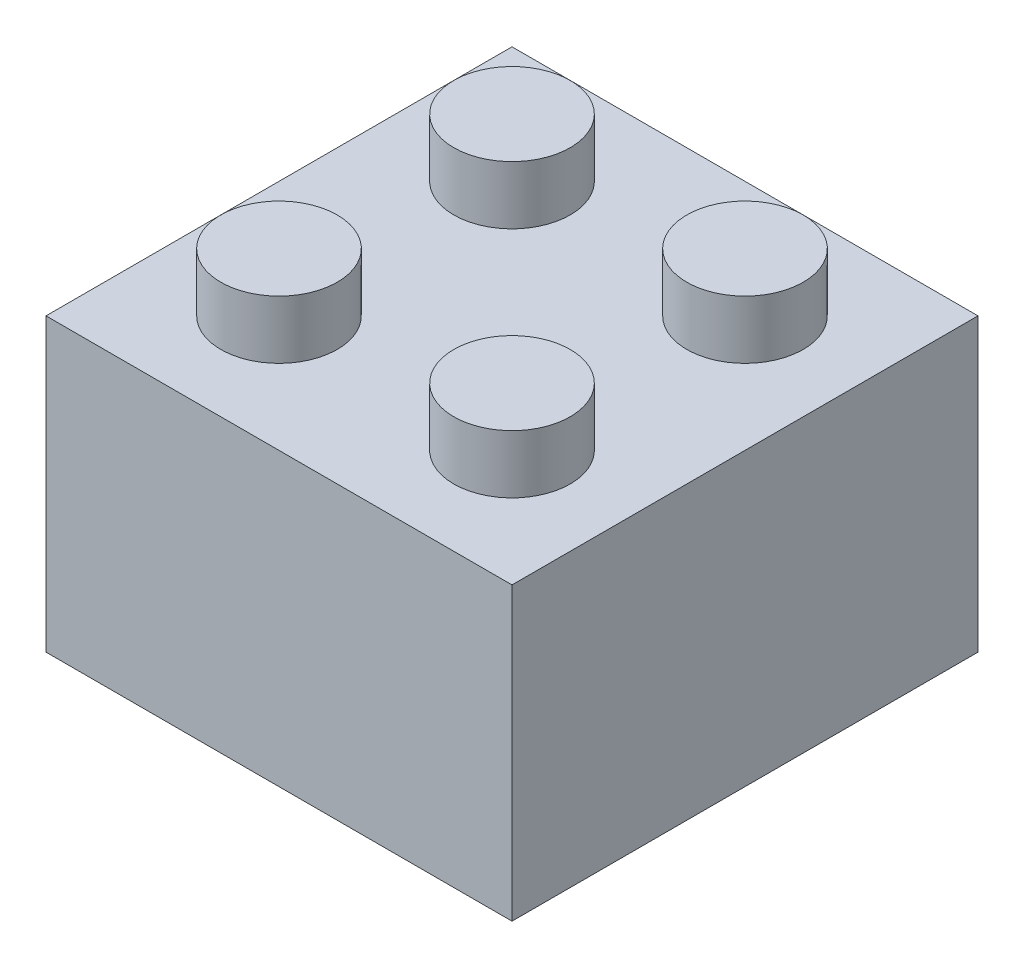
ISO-10303-21;
HEADER;
FILE_DESCRIPTION(('STEP AP214'),'2;1');
FILE_NAME('part.step','',(''),(''),'','','');
FILE_SCHEMA(('AUTOMOTIVE_DESIGN { 1 0 10303 214 1 1 1 1 }'));
ENDSEC;
DATA;
#1=APPLICATION_CONTEXT('core data for automotive mechanical design processes');
#2=APPLICATION_PROTOCOL_DEFINITION('international standard','automotive_design',2000,#1);
#3=PRODUCT_CONTEXT('',#1,'mechanical');
#4=PRODUCT('Part','Part','',(#3));
#5=PRODUCT_RELATED_PRODUCT_CATEGORY('part','',(#4));
#6=PRODUCT_DEFINITION_FORMATION('','',#4);
#7=PRODUCT_DEFINITION_CONTEXT('part definition',#1,'design');
#8=PRODUCT_DEFINITION('design','',#6,#7);
#9=PRODUCT_DEFINITION_SHAPE('','',#8);
#10=(LENGTH_UNIT() NAMED_UNIT(*) SI_UNIT(.MILLI.,.METRE.));
#11=(NAMED_UNIT(*) PLANE_ANGLE_UNIT() SI_UNIT($,.RADIAN.));
#12=(NAMED_UNIT(*) SI_UNIT($,.STERADIAN.) SOLID_ANGLE_UNIT());
#13=UNCERTAINTY_MEASURE_WITH_UNIT(LENGTH_MEASURE(1.E-05),#10,'distance_accuracy_value','');
#14=(GEOMETRIC_REPRESENTATION_CONTEXT(3) GLOBAL_UNCERTAINTY_ASSIGNED_CONTEXT((#13)) GLOBAL_UNIT_ASSIGNED_CONTEXT((#10,
#11,#12)) REPRESENTATION_CONTEXT('',''));
#15=CARTESIAN_POINT('',(0.,0.,0.));
#16=DIRECTION('',(0.,0.,1.));
#17=DIRECTION('',(1.,0.,0.));
#18=AXIS2_PLACEMENT_3D('',#15,#16,#17);
#19=CARTESIAN_POINT('',(0.,9.,0.));
#20=DIRECTION('',(0.,1.,0.));
#21=DIRECTION('',(0.,0.,1.));
#22=AXIS2_PLACEMENT_3D('',#19,#20,#21);
#23=PLANE('',#22);
#24=CARTESIAN_POINT('',(-3.99999999999999,9.,4.));
#25=DIRECTION('',(0.,1.,0.));
#26=DIRECTION('',(0.,0.,1.));
#27=AXIS2_PLACEMENT_3D('',#24,#25,#26);
#28=CIRCLE('',#27,1.);
#29=CARTESIAN_POINT('',(-3.99999999999999,9.,5.));
#30=VERTEX_POINT('',#29);
#31=EDGE_CURVE('E161',#30,#30,#28,.T.);
#32=ORIENTED_EDGE('',*,*,#31,.T.);
#33=EDGE_LOOP('',(#32));
#34=FACE_BOUND('',#33,.T.);
#35=CARTESIAN_POINT('',(-3.99999999999999,9.,-4.));
#36=DIRECTION('',(0.,1.,0.));
#37=DIRECTION('',(0.,0.,1.));
#38=AXIS2_PLACEMENT_3D('',#35,#36,#37);
#39=CIRCLE('',#38,1.);
#40=CARTESIAN_POINT('',(-3.99999999999999,9.,-3.));
#41=VERTEX_POINT('',#40);
#42=EDGE_CURVE('E156',#41,#41,#39,.T.);
#43=ORIENTED_EDGE('',*,*,#42,.T.);
#44=EDGE_LOOP('',(#43));
#45=FACE_BOUND('',#44,.T.);
#46=DIRECTION('',(0.,0.,1.));
#47=VECTOR('',#46,1.);
#48=CARTESIAN_POINT('',(-6.99999999999999,9.,8.));
#49=LINE('',#48,#47);
#50=CARTESIAN_POINT('',(-6.99999999999999,9.,-7.));
#51=VERTEX_POINT('',#50);
#52=CARTESIAN_POINT('',(-6.99999999999999,9.,7.));
#53=VERTEX_POINT('',#52);
#54=EDGE_CURVE('E124',#51,#53,#49,.T.);
#55=ORIENTED_EDGE('',*,*,#54,.F.);
#56=DIRECTION('',(-1.,0.,0.));
#57=VECTOR('',#56,1.);
#58=CARTESIAN_POINT('',(8.00000000000001,9.,-7.));
#59=LINE('',#58,#57);
#60=CARTESIAN_POINT('',(7.00000000000001,9.,-7.));
#61=VERTEX_POINT('',#60);
#62=EDGE_CURVE('E132',#61,#51,#59,.T.);
#63=ORIENTED_EDGE('',*,*,#62,.F.);
#64=DIRECTION('',(0.,0.,-1.));
#65=VECTOR('',#64,1.);
#66=CARTESIAN_POINT('',(7.00000000000001,9.,8.));
#67=LINE('',#66,#65);
#68=CARTESIAN_POINT('',(7.00000000000001,9.,7.));
#69=VERTEX_POINT('',#68);
#70=EDGE_CURVE('E123',#69,#61,#67,.T.);
#71=ORIENTED_EDGE('',*,*,#70,.F.);
#72=DIRECTION('',(1.,0.,0.));
#73=VECTOR('',#72,1.);
#74=CARTESIAN_POINT('',(8.00000000000001,9.,7.));
#75=LINE('',#74,#73);
#76=EDGE_CURVE('E113',#53,#69,#75,.T.);
#77=ORIENTED_EDGE('',*,*,#76,.F.);
#78=EDGE_LOOP('',(#55,#63,#71,#77));
#79=FACE_BOUND('',#78,.T.);
#80=CARTESIAN_POINT('',(4.00000000000001,9.,-4.));
#81=DIRECTION('',(0.,1.,0.));
#82=DIRECTION('',(0.,0.,1.));
#83=AXIS2_PLACEMENT_3D('',#80,#81,#82);
#84=CIRCLE('',#83,1.);
#85=CARTESIAN_POINT('',(4.00000000000001,9.,-3.));
#86=VERTEX_POINT('',#85);
#87=EDGE_CURVE('E138',#86,#86,#84,.T.);
#88=ORIENTED_EDGE('',*,*,#87,.T.);
#89=EDGE_LOOP('',(#88));
#90=FACE_BOUND('',#89,.T.);
#91=CARTESIAN_POINT('',(4.00000000000001,9.,4.));
#92=DIRECTION('',(0.,1.,0.));
#93=DIRECTION('',(0.,0.,1.));
#94=AXIS2_PLACEMENT_3D('',#91,#92,#93);
#95=CIRCLE('',#94,1.);
#96=CARTESIAN_POINT('',(4.00000000000001,9.,5.));
#97=VERTEX_POINT('',#96);
#98=EDGE_CURVE('E143',#97,#97,#95,.T.);
#99=ORIENTED_EDGE('',*,*,#98,.T.);
#100=EDGE_LOOP('',(#99));
#101=FACE_BOUND('',#100,.T.);
#102=CARTESIAN_POINT('',(0.,9.,0.));
#103=DIRECTION('',(0.,1.,0.));
#104=DIRECTION('',(0.,0.,1.));
#105=AXIS2_PLACEMENT_3D('',#102,#103,#104);
#106=CIRCLE('',#105,2.7);
#107=CARTESIAN_POINT('',(0.,9.,2.7));
#108=VERTEX_POINT('',#107);
#109=EDGE_CURVE('E12',#108,#108,#106,.F.);
#110=ORIENTED_EDGE('',*,*,#109,.F.);
#111=EDGE_LOOP('',(#110));
#112=FACE_BOUND('',#111,.T.);
#113=ADVANCED_FACE('F38',(#34,#45,#79,#90,#101,#112),#23,.F.);
#114=CARTESIAN_POINT('',(0.,10.,0.));
#115=DIRECTION('',(0.,1.,0.));
#116=DIRECTION('',(0.,0.,1.));
#117=AXIS2_PLACEMENT_3D('',#114,#115,#116);
#118=PLANE('',#117);
#119=CARTESIAN_POINT('',(-3.99999999999999,10.,4.));
#120=DIRECTION('',(0.,1.,0.));
#121=DIRECTION('',(0.,0.,-1.));
#122=AXIS2_PLACEMENT_3D('',#119,#120,#121);
#123=CIRCLE('',#122,2.);
#124=CARTESIAN_POINT('',(-3.99999999999999,10.,2.));
#125=VERTEX_POINT('',#124);
#126=EDGE_CURVE('E175',#125,#125,#123,.T.);
#127=ORIENTED_EDGE('',*,*,#126,.F.);
#128=EDGE_LOOP('',(#127));
#129=FACE_BOUND('',#128,.T.);
#130=CARTESIAN_POINT('',(-3.99999999999999,10.,-4.));
#131=DIRECTION('',(0.,1.,0.));
#132=DIRECTION('',(0.,0.,1.));
#133=AXIS2_PLACEMENT_3D('',#130,#131,#132);
#134=CIRCLE('',#133,2.);
#135=CARTESIAN_POINT('',(-3.99999999999999,10.,-2.));
#136=VERTEX_POINT('',#135);
#137=EDGE_CURVE('E187',#136,#136,#134,.T.);
#138=ORIENTED_EDGE('',*,*,#137,.F.);
#139=EDGE_LOOP('',(#138));
#140=FACE_BOUND('',#139,.T.);
#141=DIRECTION('',(0.,0.,1.));
#142=VECTOR('',#141,1.);
#143=CARTESIAN_POINT('',(-7.99999999999999,10.,8.));
#144=LINE('',#143,#142);
#145=CARTESIAN_POINT('',(-7.99999999999999,10.,-8.));
#146=VERTEX_POINT('',#145);
#147=CARTESIAN_POINT('',(-7.99999999999999,10.,8.));
#148=VERTEX_POINT('',#147);
#149=EDGE_CURVE('E196',#146,#148,#144,.T.);
#150=ORIENTED_EDGE('',*,*,#149,.T.);
#151=DIRECTION('',(1.,0.,0.));
#152=VECTOR('',#151,1.);
#153=CARTESIAN_POINT('',(8.00000000000001,10.,8.));
#154=LINE('',#153,#152);
#155=CARTESIAN_POINT('',(8.00000000000001,10.,8.));
#156=VERTEX_POINT('',#155);
#157=EDGE_CURVE('E91',#148,#156,#154,.T.);
#158=ORIENTED_EDGE('',*,*,#157,.T.);
#159=DIRECTION('',(0.,0.,-1.));
#160=VECTOR('',#159,1.);
#161=CARTESIAN_POINT('',(8.00000000000001,10.,8.));
#162=LINE('',#161,#160);
#163=CARTESIAN_POINT('',(8.00000000000001,10.,-8.));
#164=VERTEX_POINT('',#163);
#165=EDGE_CURVE('E199',#156,#164,#162,.T.);
#166=ORIENTED_EDGE('',*,*,#165,.T.);
#167=DIRECTION('',(-1.,0.,0.));
#168=VECTOR('',#167,1.);
#169=CARTESIAN_POINT('',(8.00000000000001,10.,-8.));
#170=LINE('',#169,#168);
#171=EDGE_CURVE('E62',#164,#146,#170,.T.);
#172=ORIENTED_EDGE('',*,*,#171,.T.);
#173=EDGE_LOOP('',(#150,#158,#166,#172));
#174=FACE_BOUND('',#173,.T.);
#175=CARTESIAN_POINT('',(4.00000000000001,10.,-4.));
#176=DIRECTION('',(0.,1.,0.));
#177=DIRECTION('',(0.,0.,-1.));
#178=AXIS2_PLACEMENT_3D('',#175,#176,#177);
#179=CIRCLE('',#178,2.);
#180=CARTESIAN_POINT('',(4.00000000000001,10.,-6.));
#181=VERTEX_POINT('',#180);
#182=EDGE_CURVE('E181',#181,#181,#179,.T.);
#183=ORIENTED_EDGE('',*,*,#182,.F.);
#184=EDGE_LOOP('',(#183));
#185=FACE_BOUND('',#184,.T.);
#186=CARTESIAN_POINT('',(4.00000000000001,10.,4.));
#187=DIRECTION('',(0.,1.,0.));
#188=DIRECTION('',(0.,0.,1.));
#189=AXIS2_PLACEMENT_3D('',#186,#187,#188);
#190=CIRCLE('',#189,2.);
#191=CARTESIAN_POINT('',(4.00000000000001,10.,6.));
#192=VERTEX_POINT('',#191);
#193=EDGE_CURVE('E149',#192,#192,#190,.T.);
#194=ORIENTED_EDGE('',*,*,#193,.F.);
#195=EDGE_LOOP('',(#194));
#196=FACE_BOUND('',#195,.T.);
#197=ADVANCED_FACE('F228',(#129,#140,#174,#185,#196),#118,.T.);
#198=CARTESIAN_POINT('',(-7.99999999999999,10.,8.));
#199=DIRECTION('',(1.,0.,0.));
#200=DIRECTION('',(0.,0.,-1.));
#201=AXIS2_PLACEMENT_3D('',#198,#199,#200);
#202=PLANE('',#201);
#203=DIRECTION('',(0.,0.,1.));
#204=VECTOR('',#203,1.);
#205=CARTESIAN_POINT('',(-7.99999999999999,0.,8.));
#206=LINE('',#205,#204);
#207=CARTESIAN_POINT('',(-7.99999999999999,0.,-8.));
#208=VERTEX_POINT('',#207);
#209=CARTESIAN_POINT('',(-7.99999999999999,0.,8.));
#210=VERTEX_POINT('',#209);
#211=EDGE_CURVE('E193',#208,#210,#206,.T.);
#212=ORIENTED_EDGE('',*,*,#211,.T.);
#213=DIRECTION('',(0.,-1.,0.));
#214=VECTOR('',#213,1.);
#215=CARTESIAN_POINT('',(-7.99999999999999,10.,8.));
#216=LINE('',#215,#214);
#217=EDGE_CURVE('E46',#148,#210,#216,.T.);
#218=ORIENTED_EDGE('',*,*,#217,.F.);
#219=ORIENTED_EDGE('',*,*,#149,.F.);
#220=DIRECTION('',(0.,-1.,0.));
#221=VECTOR('',#220,1.);
#222=CARTESIAN_POINT('',(-7.99999999999999,10.,-8.));
#223=LINE('',#222,#221);
#224=EDGE_CURVE('E202',#146,#208,#223,.T.);
#225=ORIENTED_EDGE('',*,*,#224,.T.);
#226=EDGE_LOOP('',(#212,#218,#219,#225));
#227=FACE_BOUND('',#226,.T.);
#228=ADVANCED_FACE('F40',(#227),#202,.F.);
#229=CARTESIAN_POINT('',(8.00000000000001,10.,8.));
#230=DIRECTION('',(0.,0.,-1.));
#231=DIRECTION('',(-1.,0.,0.));
#232=AXIS2_PLACEMENT_3D('',#229,#230,#231);
#233=PLANE('',#232);
#234=DIRECTION('',(1.,0.,0.));
#235=VECTOR('',#234,1.);
#236=CARTESIAN_POINT('',(8.00000000000001,0.,8.));
#237=LINE('',#236,#235);
#238=CARTESIAN_POINT('',(8.00000000000001,0.,8.));
#239=VERTEX_POINT('',#238);
#240=EDGE_CURVE('E205',#210,#239,#237,.T.);
#241=ORIENTED_EDGE('',*,*,#240,.T.);
#242=DIRECTION('',(0.,-1.,0.));
#243=VECTOR('',#242,1.);
#244=CARTESIAN_POINT('',(8.00000000000001,10.,8.));
#245=LINE('',#244,#243);
#246=EDGE_CURVE('E213',#156,#239,#245,.T.);
#247=ORIENTED_EDGE('',*,*,#246,.F.);
#248=ORIENTED_EDGE('',*,*,#157,.F.);
#249=ORIENTED_EDGE('',*,*,#217,.T.);
#250=EDGE_LOOP('',(#241,#247,#248,#249));
#251=FACE_BOUND('',#250,.T.);
#252=ADVANCED_FACE('F216',(#251),#233,.F.);
#253=CARTESIAN_POINT('',(8.00000000000001,10.,8.));
#254=DIRECTION('',(-1.,0.,0.));
#255=DIRECTION('',(0.,0.,1.));
#256=AXIS2_PLACEMENT_3D('',#253,#254,#255);
#257=PLANE('',#256);
#258=DIRECTION('',(0.,0.,-1.));
#259=VECTOR('',#258,1.);
#260=CARTESIAN_POINT('',(8.00000000000001,0.,8.));
#261=LINE('',#260,#259);
#262=CARTESIAN_POINT('',(8.00000000000001,0.,-8.));
#263=VERTEX_POINT('',#262);
#264=EDGE_CURVE('E207',#239,#263,#261,.T.);
#265=ORIENTED_EDGE('',*,*,#264,.T.);
#266=DIRECTION('',(0.,-1.,0.));
#267=VECTOR('',#266,1.);
#268=CARTESIAN_POINT('',(8.00000000000001,10.,-8.));
#269=LINE('',#268,#267);
#270=EDGE_CURVE('E211',#164,#263,#269,.T.);
#271=ORIENTED_EDGE('',*,*,#270,.F.);
#272=ORIENTED_EDGE('',*,*,#165,.F.);
#273=ORIENTED_EDGE('',*,*,#246,.T.);
#274=EDGE_LOOP('',(#265,#271,#272,#273));
#275=FACE_BOUND('',#274,.T.);
#276=ADVANCED_FACE('F225',(#275),#257,.F.);
#277=CARTESIAN_POINT('',(8.00000000000001,10.,-8.));
#278=DIRECTION('',(0.,0.,1.));
#279=DIRECTION('',(1.,0.,0.));
#280=AXIS2_PLACEMENT_3D('',#277,#278,#279);
#281=PLANE('',#280);
#282=DIRECTION('',(-1.,0.,0.));
#283=VECTOR('',#282,1.);
#284=CARTESIAN_POINT('',(8.00000000000001,0.,-8.));
#285=LINE('',#284,#283);
#286=EDGE_CURVE('E83',#263,#208,#285,.T.);
#287=ORIENTED_EDGE('',*,*,#286,.T.);
#288=ORIENTED_EDGE('',*,*,#224,.F.);
#289=ORIENTED_EDGE('',*,*,#171,.F.);
#290=ORIENTED_EDGE('',*,*,#270,.T.);
#291=EDGE_LOOP('',(#287,#288,#289,#290));
#292=FACE_BOUND('',#291,.T.);
#293=ADVANCED_FACE('F227',(#292),#281,.F.);
#294=CARTESIAN_POINT('',(0.,0.,0.));
#295=DIRECTION('',(0.,1.,0.));
#296=DIRECTION('',(0.,0.,1.));
#297=AXIS2_PLACEMENT_3D('',#294,#295,#296);
#298=PLANE('',#297);
#299=DIRECTION('',(-1.,0.,0.));
#300=VECTOR('',#299,1.);
#301=CARTESIAN_POINT('',(8.00000000000001,0.,-7.));
#302=LINE('',#301,#300);
#303=CARTESIAN_POINT('',(7.00000000000001,0.,-7.));
#304=VERTEX_POINT('',#303);
#305=CARTESIAN_POINT('',(-6.99999999999999,0.,-7.));
#306=VERTEX_POINT('',#305);
#307=EDGE_CURVE('E167',#304,#306,#302,.T.);
#308=ORIENTED_EDGE('',*,*,#307,.T.);
#309=DIRECTION('',(0.,0.,1.));
#310=VECTOR('',#309,1.);
#311=CARTESIAN_POINT('',(-6.99999999999999,0.,8.));
#312=LINE('',#311,#310);
#313=CARTESIAN_POINT('',(-6.99999999999999,0.,7.));
#314=VERTEX_POINT('',#313);
#315=EDGE_CURVE('E155',#306,#314,#312,.T.);
#316=ORIENTED_EDGE('',*,*,#315,.T.);
#317=DIRECTION('',(1.,0.,0.));
#318=VECTOR('',#317,1.);
#319=CARTESIAN_POINT('',(8.00000000000001,0.,7.));
#320=LINE('',#319,#318);
#321=CARTESIAN_POINT('',(7.00000000000001,0.,7.));
#322=VERTEX_POINT('',#321);
#323=EDGE_CURVE('E166',#314,#322,#320,.T.);
#324=ORIENTED_EDGE('',*,*,#323,.T.);
#325=DIRECTION('',(0.,0.,-1.));
#326=VECTOR('',#325,1.);
#327=CARTESIAN_POINT('',(7.00000000000001,0.,8.));
#328=LINE('',#327,#326);
#329=EDGE_CURVE('E53',#322,#304,#328,.T.);
#330=ORIENTED_EDGE('',*,*,#329,.T.);
#331=EDGE_LOOP('',(#308,#316,#324,#330));
#332=FACE_BOUND('',#331,.T.);
#333=ORIENTED_EDGE('',*,*,#211,.F.);
#334=ORIENTED_EDGE('',*,*,#286,.F.);
#335=ORIENTED_EDGE('',*,*,#264,.F.);
#336=ORIENTED_EDGE('',*,*,#240,.F.);
#337=EDGE_LOOP('',(#333,#334,#335,#336));
#338=FACE_BOUND('',#337,.T.);
#339=ADVANCED_FACE('F221',(#332,#338),#298,.F.);
#340=CARTESIAN_POINT('',(-3.99999999999999,12.,-4.));
#341=DIRECTION('',(0.,-1.,0.));
#342=DIRECTION('',(0.,0.,-1.));
#343=AXIS2_PLACEMENT_3D('',#340,#341,#342);
#344=CYLINDRICAL_SURFACE('',#343,2.);
#345=CARTESIAN_POINT('',(-3.99999999999999,12.,-4.));
#346=DIRECTION('',(0.,1.,0.));
#347=DIRECTION('',(0.,0.,1.));
#348=AXIS2_PLACEMENT_3D('',#345,#346,#347);
#349=CIRCLE('',#348,2.);
#350=CARTESIAN_POINT('',(-3.99999999999999,12.,-2.));
#351=VERTEX_POINT('',#350);
#352=EDGE_CURVE('E190',#351,#351,#349,.T.);
#353=ORIENTED_EDGE('',*,*,#352,.F.);
#354=EDGE_LOOP('',(#353));
#355=FACE_BOUND('',#354,.T.);
#356=ORIENTED_EDGE('',*,*,#137,.T.);
#357=EDGE_LOOP('',(#356));
#358=FACE_BOUND('',#357,.T.);
#359=ADVANCED_FACE('F294',(#355,#358),#344,.T.);
#360=CARTESIAN_POINT('',(-3.99999999999999,12.,-4.));
#361=DIRECTION('',(0.,1.,0.));
#362=DIRECTION('',(0.,0.,1.));
#363=AXIS2_PLACEMENT_3D('',#360,#361,#362);
#364=PLANE('',#363);
#365=ORIENTED_EDGE('',*,*,#352,.T.);
#366=EDGE_LOOP('',(#365));
#367=FACE_BOUND('',#366,.T.);
#368=ADVANCED_FACE('F300',(#367),#364,.T.);
#369=CARTESIAN_POINT('',(4.00000000000001,12.,-4.));
#370=DIRECTION('',(0.,-1.,0.));
#371=DIRECTION('',(0.,0.,-1.));
#372=AXIS2_PLACEMENT_3D('',#369,#370,#371);
#373=CYLINDRICAL_SURFACE('',#372,2.);
#374=CARTESIAN_POINT('',(4.00000000000001,12.,-4.));
#375=DIRECTION('',(0.,1.,0.));
#376=DIRECTION('',(0.,0.,-1.));
#377=AXIS2_PLACEMENT_3D('',#374,#375,#376);
#378=CIRCLE('',#377,2.);
#379=CARTESIAN_POINT('',(4.00000000000001,12.,-6.));
#380=VERTEX_POINT('',#379);
#381=EDGE_CURVE('E184',#380,#380,#378,.T.);
#382=ORIENTED_EDGE('',*,*,#381,.F.);
#383=EDGE_LOOP('',(#382));
#384=FACE_BOUND('',#383,.T.);
#385=ORIENTED_EDGE('',*,*,#182,.T.);
#386=EDGE_LOOP('',(#385));
#387=FACE_BOUND('',#386,.T.);
#388=ADVANCED_FACE('F336',(#384,#387),#373,.T.);
#389=CARTESIAN_POINT('',(4.00000000000001,12.,-4.));
#390=DIRECTION('',(0.,-1.,0.));
#391=DIRECTION('',(0.,0.,-1.));
#392=AXIS2_PLACEMENT_3D('',#389,#390,#391);
#393=PLANE('',#392);
#394=ORIENTED_EDGE('',*,*,#381,.T.);
#395=EDGE_LOOP('',(#394));
#396=FACE_BOUND('',#395,.T.);
#397=ADVANCED_FACE('F346',(#396),#393,.F.);
#398=CARTESIAN_POINT('',(-3.99999999999999,12.,4.));
#399=DIRECTION('',(0.,-1.,0.));
#400=DIRECTION('',(0.,0.,-1.));
#401=AXIS2_PLACEMENT_3D('',#398,#399,#400);
#402=CYLINDRICAL_SURFACE('',#401,2.);
#403=CARTESIAN_POINT('',(-3.99999999999999,12.,4.));
#404=DIRECTION('',(0.,1.,0.));
#405=DIRECTION('',(0.,0.,-1.));
#406=AXIS2_PLACEMENT_3D('',#403,#404,#405);
#407=CIRCLE('',#406,2.);
#408=CARTESIAN_POINT('',(-3.99999999999999,12.,2.));
#409=VERTEX_POINT('',#408);
#410=EDGE_CURVE('E178',#409,#409,#407,.T.);
#411=ORIENTED_EDGE('',*,*,#410,.F.);
#412=EDGE_LOOP('',(#411));
#413=FACE_BOUND('',#412,.T.);
#414=ORIENTED_EDGE('',*,*,#126,.T.);
#415=EDGE_LOOP('',(#414));
#416=FACE_BOUND('',#415,.T.);
#417=ADVANCED_FACE('F250',(#413,#416),#402,.T.);
#418=CARTESIAN_POINT('',(-3.99999999999999,12.,4.));
#419=DIRECTION('',(0.,-1.,0.));
#420=DIRECTION('',(0.,0.,-1.));
#421=AXIS2_PLACEMENT_3D('',#418,#419,#420);
#422=PLANE('',#421);
#423=ORIENTED_EDGE('',*,*,#410,.T.);
#424=EDGE_LOOP('',(#423));
#425=FACE_BOUND('',#424,.T.);
#426=ADVANCED_FACE('F240',(#425),#422,.F.);
#427=CARTESIAN_POINT('',(4.00000000000001,12.,4.));
#428=DIRECTION('',(0.,-1.,0.));
#429=DIRECTION('',(0.,0.,-1.));
#430=AXIS2_PLACEMENT_3D('',#427,#428,#429);
#431=CYLINDRICAL_SURFACE('',#430,2.);
#432=CARTESIAN_POINT('',(4.00000000000001,12.,4.));
#433=DIRECTION('',(0.,1.,0.));
#434=DIRECTION('',(0.,0.,1.));
#435=AXIS2_PLACEMENT_3D('',#432,#433,#434);
#436=CIRCLE('',#435,2.);
#437=CARTESIAN_POINT('',(4.00000000000001,12.,6.));
#438=VERTEX_POINT('',#437);
#439=EDGE_CURVE('E172',#438,#438,#436,.T.);
#440=ORIENTED_EDGE('',*,*,#439,.F.);
#441=EDGE_LOOP('',(#440));
#442=FACE_BOUND('',#441,.T.);
#443=ORIENTED_EDGE('',*,*,#193,.T.);
#444=EDGE_LOOP('',(#443));
#445=FACE_BOUND('',#444,.T.);
#446=ADVANCED_FACE('F237',(#442,#445),#431,.T.);
#447=CARTESIAN_POINT('',(4.00000000000001,12.,4.));
#448=DIRECTION('',(0.,1.,0.));
#449=DIRECTION('',(0.,0.,1.));
#450=AXIS2_PLACEMENT_3D('',#447,#448,#449);
#451=PLANE('',#450);
#452=ORIENTED_EDGE('',*,*,#439,.T.);
#453=EDGE_LOOP('',(#452));
#454=FACE_BOUND('',#453,.T.);
#455=ADVANCED_FACE('F239',(#454),#451,.T.);
#456=CARTESIAN_POINT('',(-6.99999999999999,10.,8.));
#457=DIRECTION('',(1.,0.,0.));
#458=DIRECTION('',(0.,0.,-1.));
#459=AXIS2_PLACEMENT_3D('',#456,#457,#458);
#460=PLANE('',#459);
#461=ORIENTED_EDGE('',*,*,#315,.F.);
#462=DIRECTION('',(0.,-1.,0.));
#463=VECTOR('',#462,1.);
#464=CARTESIAN_POINT('',(-6.99999999999999,10.,-7.));
#465=LINE('',#464,#463);
#466=EDGE_CURVE('E134',#51,#306,#465,.T.);
#467=ORIENTED_EDGE('',*,*,#466,.F.);
#468=ORIENTED_EDGE('',*,*,#54,.T.);
#469=DIRECTION('',(0.,-1.,0.));
#470=VECTOR('',#469,1.);
#471=CARTESIAN_POINT('',(-6.99999999999999,10.,7.));
#472=LINE('',#471,#470);
#473=EDGE_CURVE('E118',#53,#314,#472,.T.);
#474=ORIENTED_EDGE('',*,*,#473,.T.);
#475=EDGE_LOOP('',(#461,#467,#468,#474));
#476=FACE_BOUND('',#475,.T.);
#477=ADVANCED_FACE('F247',(#476),#460,.T.);
#478=CARTESIAN_POINT('',(8.00000000000001,10.,7.));
#479=DIRECTION('',(0.,0.,-1.));
#480=DIRECTION('',(-1.,0.,0.));
#481=AXIS2_PLACEMENT_3D('',#478,#479,#480);
#482=PLANE('',#481);
#483=ORIENTED_EDGE('',*,*,#323,.F.);
#484=ORIENTED_EDGE('',*,*,#473,.F.);
#485=ORIENTED_EDGE('',*,*,#76,.T.);
#486=DIRECTION('',(0.,-1.,0.));
#487=VECTOR('',#486,1.);
#488=CARTESIAN_POINT('',(7.00000000000001,10.,7.));
#489=LINE('',#488,#487);
#490=EDGE_CURVE('E115',#69,#322,#489,.T.);
#491=ORIENTED_EDGE('',*,*,#490,.T.);
#492=EDGE_LOOP('',(#483,#484,#485,#491));
#493=FACE_BOUND('',#492,.T.);
#494=ADVANCED_FACE('F114',(#493),#482,.T.);
#495=CARTESIAN_POINT('',(7.00000000000001,10.,8.));
#496=DIRECTION('',(-1.,0.,0.));
#497=DIRECTION('',(0.,0.,1.));
#498=AXIS2_PLACEMENT_3D('',#495,#496,#497);
#499=PLANE('',#498);
#500=ORIENTED_EDGE('',*,*,#329,.F.);
#501=ORIENTED_EDGE('',*,*,#490,.F.);
#502=ORIENTED_EDGE('',*,*,#70,.T.);
#503=DIRECTION('',(0.,-1.,0.));
#504=VECTOR('',#503,1.);
#505=CARTESIAN_POINT('',(7.00000000000001,10.,-7.));
#506=LINE('',#505,#504);
#507=EDGE_CURVE('E128',#61,#304,#506,.T.);
#508=ORIENTED_EDGE('',*,*,#507,.T.);
#509=EDGE_LOOP('',(#500,#501,#502,#508));
#510=FACE_BOUND('',#509,.T.);
#511=ADVANCED_FACE('F126',(#510),#499,.T.);
#512=CARTESIAN_POINT('',(8.00000000000001,10.,-7.));
#513=DIRECTION('',(0.,0.,1.));
#514=DIRECTION('',(1.,0.,0.));
#515=AXIS2_PLACEMENT_3D('',#512,#513,#514);
#516=PLANE('',#515);
#517=ORIENTED_EDGE('',*,*,#307,.F.);
#518=ORIENTED_EDGE('',*,*,#507,.F.);
#519=ORIENTED_EDGE('',*,*,#62,.T.);
#520=ORIENTED_EDGE('',*,*,#466,.T.);
#521=EDGE_LOOP('',(#517,#518,#519,#520));
#522=FACE_BOUND('',#521,.T.);
#523=ADVANCED_FACE('F291',(#522),#516,.T.);
#524=CARTESIAN_POINT('',(-3.99999999999999,12.,-4.));
#525=DIRECTION('',(0.,-1.,0.));
#526=DIRECTION('',(0.,0.,-1.));
#527=AXIS2_PLACEMENT_3D('',#524,#525,#526);
#528=CYLINDRICAL_SURFACE('',#527,1.);
#529=CARTESIAN_POINT('',(-3.99999999999999,11.,-4.));
#530=DIRECTION('',(0.,1.,0.));
#531=DIRECTION('',(0.,0.,1.));
#532=AXIS2_PLACEMENT_3D('',#529,#530,#531);
#533=CIRCLE('',#532,1.);
#534=CARTESIAN_POINT('',(-3.99999999999999,11.,-3.));
#535=VERTEX_POINT('',#534);
#536=EDGE_CURVE('E152',#535,#535,#533,.T.);
#537=ORIENTED_EDGE('',*,*,#536,.T.);
#538=EDGE_LOOP('',(#537));
#539=FACE_BOUND('',#538,.T.);
#540=ORIENTED_EDGE('',*,*,#42,.F.);
#541=EDGE_LOOP('',(#540));
#542=FACE_BOUND('',#541,.T.);
#543=ADVANCED_FACE('F417',(#539,#542),#528,.F.);
#544=CARTESIAN_POINT('',(-3.99999999999999,11.,-4.));
#545=DIRECTION('',(0.,1.,0.));
#546=DIRECTION('',(0.,0.,1.));
#547=AXIS2_PLACEMENT_3D('',#544,#545,#546);
#548=PLANE('',#547);
#549=ORIENTED_EDGE('',*,*,#536,.F.);
#550=EDGE_LOOP('',(#549));
#551=FACE_BOUND('',#550,.T.);
#552=ADVANCED_FACE('F426',(#551),#548,.F.);
#553=CARTESIAN_POINT('',(4.00000000000001,12.,-4.));
#554=DIRECTION('',(0.,-1.,0.));
#555=DIRECTION('',(0.,0.,-1.));
#556=AXIS2_PLACEMENT_3D('',#553,#554,#555);
#557=CYLINDRICAL_SURFACE('',#556,1.);
#558=CARTESIAN_POINT('',(4.00000000000001,11.,-4.));
#559=DIRECTION('',(0.,-1.,0.));
#560=DIRECTION('',(0.,0.,-1.));
#561=AXIS2_PLACEMENT_3D('',#558,#559,#560);
#562=CIRCLE('',#561,1.);
#563=CARTESIAN_POINT('',(4.00000000000001,11.,-5.));
#564=VERTEX_POINT('',#563);
#565=EDGE_CURVE('E141',#564,#564,#562,.F.);
#566=ORIENTED_EDGE('',*,*,#565,.T.);
#567=EDGE_LOOP('',(#566));
#568=FACE_BOUND('',#567,.T.);
#569=ORIENTED_EDGE('',*,*,#87,.F.);
#570=EDGE_LOOP('',(#569));
#571=FACE_BOUND('',#570,.T.);
#572=ADVANCED_FACE('F436',(#568,#571),#557,.F.);
#573=CARTESIAN_POINT('',(4.00000000000001,11.,-4.));
#574=DIRECTION('',(0.,-1.,0.));
#575=DIRECTION('',(0.,0.,-1.));
#576=AXIS2_PLACEMENT_3D('',#573,#574,#575);
#577=PLANE('',#576);
#578=ORIENTED_EDGE('',*,*,#565,.F.);
#579=EDGE_LOOP('',(#578));
#580=FACE_BOUND('',#579,.T.);
#581=ADVANCED_FACE('F446',(#580),#577,.T.);
#582=CARTESIAN_POINT('',(-3.99999999999999,12.,4.));
#583=DIRECTION('',(0.,-1.,0.));
#584=DIRECTION('',(0.,0.,-1.));
#585=AXIS2_PLACEMENT_3D('',#582,#583,#584);
#586=CYLINDRICAL_SURFACE('',#585,1.);
#587=CARTESIAN_POINT('',(-3.99999999999999,11.,4.));
#588=DIRECTION('',(0.,-1.,0.));
#589=DIRECTION('',(0.,0.,-1.));
#590=AXIS2_PLACEMENT_3D('',#587,#588,#589);
#591=CIRCLE('',#590,1.);
#592=CARTESIAN_POINT('',(-3.99999999999999,11.,3.));
#593=VERTEX_POINT('',#592);
#594=EDGE_CURVE('E142',#593,#593,#591,.F.);
#595=ORIENTED_EDGE('',*,*,#594,.T.);
#596=EDGE_LOOP('',(#595));
#597=FACE_BOUND('',#596,.T.);
#598=ORIENTED_EDGE('',*,*,#31,.F.);
#599=EDGE_LOOP('',(#598));
#600=FACE_BOUND('',#599,.T.);
#601=ADVANCED_FACE('F456',(#597,#600),#586,.F.);
#602=CARTESIAN_POINT('',(-3.99999999999999,11.,4.));
#603=DIRECTION('',(0.,-1.,0.));
#604=DIRECTION('',(0.,0.,-1.));
#605=AXIS2_PLACEMENT_3D('',#602,#603,#604);
#606=PLANE('',#605);
#607=ORIENTED_EDGE('',*,*,#594,.F.);
#608=EDGE_LOOP('',(#607));
#609=FACE_BOUND('',#608,.T.);
#610=ADVANCED_FACE('F466',(#609),#606,.T.);
#611=CARTESIAN_POINT('',(4.00000000000001,12.,4.));
#612=DIRECTION('',(0.,-1.,0.));
#613=DIRECTION('',(0.,0.,-1.));
#614=AXIS2_PLACEMENT_3D('',#611,#612,#613);
#615=CYLINDRICAL_SURFACE('',#614,1.);
#616=CARTESIAN_POINT('',(4.00000000000001,11.,4.));
#617=DIRECTION('',(0.,1.,0.));
#618=DIRECTION('',(0.,0.,1.));
#619=AXIS2_PLACEMENT_3D('',#616,#617,#618);
#620=CIRCLE('',#619,1.);
#621=CARTESIAN_POINT('',(4.00000000000001,11.,5.));
#622=VERTEX_POINT('',#621);
#623=EDGE_CURVE('E146',#622,#622,#620,.T.);
#624=ORIENTED_EDGE('',*,*,#623,.T.);
#625=EDGE_LOOP('',(#624));
#626=FACE_BOUND('',#625,.T.);
#627=ORIENTED_EDGE('',*,*,#98,.F.);
#628=EDGE_LOOP('',(#627));
#629=FACE_BOUND('',#628,.T.);
#630=ADVANCED_FACE('F476',(#626,#629),#615,.F.);
#631=CARTESIAN_POINT('',(4.00000000000001,11.,4.));
#632=DIRECTION('',(0.,1.,0.));
#633=DIRECTION('',(0.,0.,1.));
#634=AXIS2_PLACEMENT_3D('',#631,#632,#633);
#635=PLANE('',#634);
#636=ORIENTED_EDGE('',*,*,#623,.F.);
#637=EDGE_LOOP('',(#636));
#638=FACE_BOUND('',#637,.T.);
#639=ADVANCED_FACE('F486',(#638),#635,.F.);
#640=CARTESIAN_POINT('',(0.,0.,0.));
#641=DIRECTION('',(0.,-1.,0.));
#642=DIRECTION('',(0.,0.,-1.));
#643=AXIS2_PLACEMENT_3D('',#640,#641,#642);
#644=PLANE('',#643);
#645=CARTESIAN_POINT('',(0.,0.,0.));
#646=DIRECTION('',(0.,-1.,0.));
#647=DIRECTION('',(0.,0.,-1.));
#648=AXIS2_PLACEMENT_3D('',#645,#646,#647);
#649=CIRCLE('',#648,2.7);
#650=CARTESIAN_POINT('',(0.,0.,-2.7));
#651=VERTEX_POINT('',#650);
#652=EDGE_CURVE('E147',#651,#651,#649,.T.);
#653=ORIENTED_EDGE('',*,*,#652,.T.);
#654=EDGE_LOOP('',(#653));
#655=FACE_BOUND('',#654,.T.);
#656=CARTESIAN_POINT('',(0.,0.,0.));
#657=DIRECTION('',(0.,-1.,0.));
#658=DIRECTION('',(0.,0.,-1.));
#659=AXIS2_PLACEMENT_3D('',#656,#657,#658);
#660=CIRCLE('',#659,1.7);
#661=CARTESIAN_POINT('',(0.,0.,-1.7));
#662=VERTEX_POINT('',#661);
#663=EDGE_CURVE('E277',#662,#662,#660,.T.);
#664=ORIENTED_EDGE('',*,*,#663,.F.);
#665=EDGE_LOOP('',(#664));
#666=FACE_BOUND('',#665,.T.);
#667=ADVANCED_FACE('F495',(#655,#666),#644,.T.);
#668=CARTESIAN_POINT('',(0.,0.,0.));
#669=DIRECTION('',(0.,1.,0.));
#670=DIRECTION('',(0.,0.,1.));
#671=AXIS2_PLACEMENT_3D('',#668,#669,#670);
#672=CYLINDRICAL_SURFACE('',#671,2.7);
#673=ORIENTED_EDGE('',*,*,#652,.F.);
#674=EDGE_LOOP('',(#673));
#675=FACE_BOUND('',#674,.T.);
#676=ORIENTED_EDGE('',*,*,#109,.T.);
#677=EDGE_LOOP('',(#676));
#678=FACE_BOUND('',#677,.T.);
#679=ADVANCED_FACE('F270',(#675,#678),#672,.T.);
#680=CARTESIAN_POINT('',(0.,0.,0.));
#681=DIRECTION('',(0.,1.,0.));
#682=DIRECTION('',(0.,0.,1.));
#683=AXIS2_PLACEMENT_3D('',#680,#681,#682);
#684=CYLINDRICAL_SURFACE('',#683,1.7);
#685=ORIENTED_EDGE('',*,*,#663,.T.);
#686=EDGE_LOOP('',(#685));
#687=FACE_BOUND('',#686,.T.);
#688=CARTESIAN_POINT('',(0.,9.,0.));
#689=DIRECTION('',(0.,-1.,0.));
#690=DIRECTION('',(0.,0.,-1.));
#691=AXIS2_PLACEMENT_3D('',#688,#689,#690);
#692=CIRCLE('',#691,1.7);
#693=CARTESIAN_POINT('',(0.,9.,-1.7));
#694=VERTEX_POINT('',#693);
#695=EDGE_CURVE('E275',#694,#694,#692,.T.);
#696=ORIENTED_EDGE('',*,*,#695,.F.);
#697=EDGE_LOOP('',(#696));
#698=FACE_BOUND('',#697,.T.);
#699=ADVANCED_FACE('F265',(#687,#698),#684,.F.);
#700=ORIENTED_EDGE('',*,*,#695,.T.);
#701=EDGE_LOOP('',(#700));
#702=FACE_BOUND('',#701,.T.);
#703=ADVANCED_FACE('F257',(#702),#23,.F.);
#704=CLOSED_SHELL('',(#113,#197,#228,#252,#276,#293,#339,#359,#368,#388,#397,#417,#426,#446,
#455,#477,#494,#511,#523,#543,#552,#572,#581,#601,#610,#630,#639,#667,#679,#699,#703));
#705=MANIFOLD_SOLID_BREP('B2',#704);
#706=ADVANCED_BREP_SHAPE_REPRESENTATION('',(#18,#705),#14);
#707=SHAPE_DEFINITION_REPRESENTATION(#9,#706);
ENDSEC;
END-ISO-10303-21;
